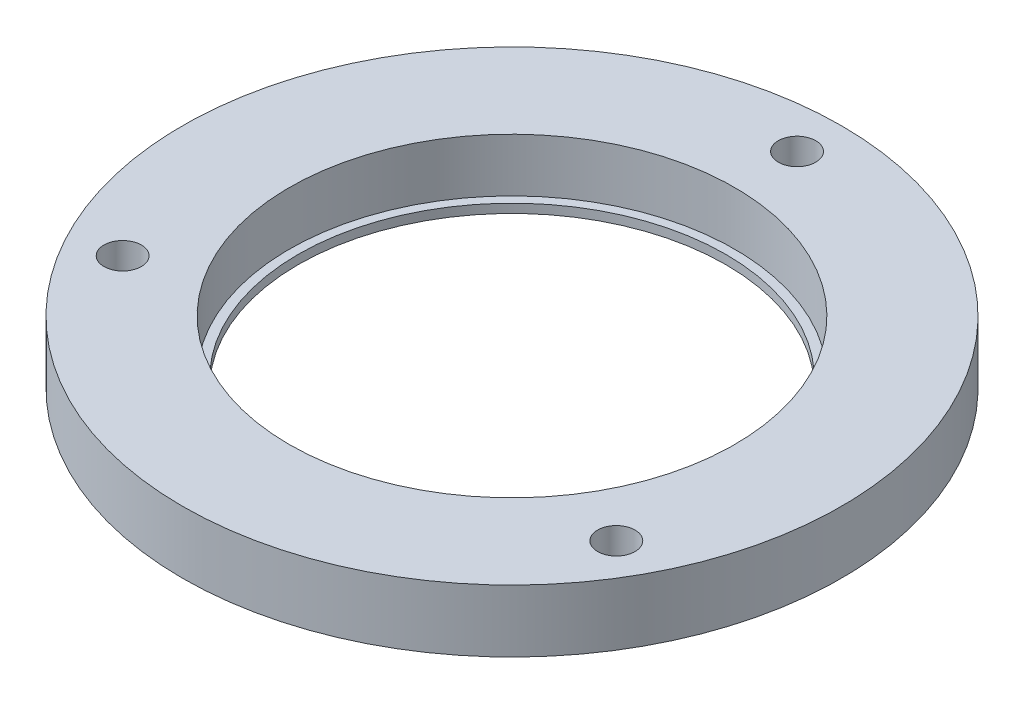
ISO-10303-21;
HEADER;
FILE_DESCRIPTION(('STEP AP214'),'2;1');
FILE_NAME('part.step','',(''),(''),'','','');
FILE_SCHEMA(('AUTOMOTIVE_DESIGN { 1 0 10303 214 1 1 1 1 }'));
ENDSEC;
DATA;
#1=APPLICATION_CONTEXT('core data for automotive mechanical design processes');
#2=APPLICATION_PROTOCOL_DEFINITION('international standard','automotive_design',2000,#1);
#3=PRODUCT_CONTEXT('',#1,'mechanical');
#4=PRODUCT('Part','Part','',(#3));
#5=PRODUCT_RELATED_PRODUCT_CATEGORY('part','',(#4));
#6=PRODUCT_DEFINITION_FORMATION('','',#4);
#7=PRODUCT_DEFINITION_CONTEXT('part definition',#1,'design');
#8=PRODUCT_DEFINITION('design','',#6,#7);
#9=PRODUCT_DEFINITION_SHAPE('','',#8);
#10=(LENGTH_UNIT() NAMED_UNIT(*) SI_UNIT(.MILLI.,.METRE.));
#11=(NAMED_UNIT(*) PLANE_ANGLE_UNIT() SI_UNIT($,.RADIAN.));
#12=(NAMED_UNIT(*) SI_UNIT($,.STERADIAN.) SOLID_ANGLE_UNIT());
#13=UNCERTAINTY_MEASURE_WITH_UNIT(LENGTH_MEASURE(1.E-05),#10,'distance_accuracy_value','');
#14=(GEOMETRIC_REPRESENTATION_CONTEXT(3) GLOBAL_UNCERTAINTY_ASSIGNED_CONTEXT((#13)) GLOBAL_UNIT_ASSIGNED_CONTEXT((#10,
#11,#12)) REPRESENTATION_CONTEXT('',''));
#15=CARTESIAN_POINT('',(0.,0.,0.));
#16=DIRECTION('',(0.,0.,1.));
#17=DIRECTION('',(1.,0.,0.));
#18=AXIS2_PLACEMENT_3D('',#15,#16,#17);
#19=CARTESIAN_POINT('',(0.,6.,0.));
#20=DIRECTION('',(0.,-1.,0.));
#21=DIRECTION('',(0.,0.,-1.));
#22=AXIS2_PLACEMENT_3D('',#19,#20,#21);
#23=CYLINDRICAL_SURFACE('',#22,37.);
#24=CARTESIAN_POINT('',(0.,6.,0.));
#25=DIRECTION('',(0.,1.,0.));
#26=DIRECTION('',(0.,0.,1.));
#27=AXIS2_PLACEMENT_3D('',#24,#25,#26);
#28=CIRCLE('',#27,37.);
#29=CARTESIAN_POINT('',(0.,6.,37.));
#30=VERTEX_POINT('',#29);
#31=EDGE_CURVE('E10',#30,#30,#28,.T.);
#32=ORIENTED_EDGE('',*,*,#31,.F.);
#33=EDGE_LOOP('',(#32));
#34=FACE_BOUND('',#33,.T.);
#35=CARTESIAN_POINT('',(0.,-1.,0.));
#36=DIRECTION('',(0.,1.,0.));
#37=DIRECTION('',(0.,0.,1.));
#38=AXIS2_PLACEMENT_3D('',#35,#36,#37);
#39=CIRCLE('',#38,37.);
#40=CARTESIAN_POINT('',(0.,-1.,37.));
#41=VERTEX_POINT('',#40);
#42=EDGE_CURVE('E60',#41,#41,#39,.T.);
#43=ORIENTED_EDGE('',*,*,#42,.T.);
#44=EDGE_LOOP('',(#43));
#45=FACE_BOUND('',#44,.T.);
#46=ADVANCED_FACE('F37',(#34,#45),#23,.T.);
#47=CARTESIAN_POINT('',(0.,6.,0.));
#48=DIRECTION('',(0.,1.,0.));
#49=DIRECTION('',(0.,0.,1.));
#50=AXIS2_PLACEMENT_3D('',#47,#48,#49);
#51=PLANE('',#50);
#52=CARTESIAN_POINT('',(0.,6.,0.));
#53=DIRECTION('',(0.,1.,0.));
#54=DIRECTION('',(0.,0.,1.));
#55=AXIS2_PLACEMENT_3D('',#52,#53,#54);
#56=CIRCLE('',#55,25.);
#57=CARTESIAN_POINT('',(0.,6.,25.));
#58=VERTEX_POINT('',#57);
#59=EDGE_CURVE('E57',#58,#58,#56,.T.);
#60=ORIENTED_EDGE('',*,*,#59,.F.);
#61=EDGE_LOOP('',(#60));
#62=FACE_BOUND('',#61,.T.);
#63=CARTESIAN_POINT('',(27.712812921102,6.,16.0000000000001));
#64=DIRECTION('',(0.,1.,0.));
#65=DIRECTION('',(-0.866025403784436,0.,-0.500000000000004));
#66=AXIS2_PLACEMENT_3D('',#63,#64,#65);
#67=CIRCLE('',#66,2.1);
#68=CARTESIAN_POINT('',(25.8941595731547,6.,14.9500000000001));
#69=VERTEX_POINT('',#68);
#70=EDGE_CURVE('E47',#69,#69,#67,.T.);
#71=ORIENTED_EDGE('',*,*,#70,.F.);
#72=EDGE_LOOP('',(#71));
#73=FACE_BOUND('',#72,.T.);
#74=CARTESIAN_POINT('',(-27.7128129211022,6.,15.9999999999997));
#75=DIRECTION('',(0.,1.,0.));
#76=DIRECTION('',(0.866025403784443,0.,-0.499999999999992));
#77=AXIS2_PLACEMENT_3D('',#74,#75,#76);
#78=CIRCLE('',#77,2.1);
#79=CARTESIAN_POINT('',(-25.8941595731549,6.,14.9499999999998));
#80=VERTEX_POINT('',#79);
#81=EDGE_CURVE('E51',#80,#80,#78,.T.);
#82=ORIENTED_EDGE('',*,*,#81,.F.);
#83=EDGE_LOOP('',(#82));
#84=FACE_BOUND('',#83,.T.);
#85=CARTESIAN_POINT('',(0.,6.,-32.));
#86=DIRECTION('',(0.,1.,0.));
#87=DIRECTION('',(0.,0.,1.));
#88=AXIS2_PLACEMENT_3D('',#85,#86,#87);
#89=CIRCLE('',#88,2.1);
#90=CARTESIAN_POINT('',(0.,6.,-29.9));
#91=VERTEX_POINT('',#90);
#92=EDGE_CURVE('E43',#91,#91,#89,.T.);
#93=ORIENTED_EDGE('',*,*,#92,.F.);
#94=EDGE_LOOP('',(#93));
#95=FACE_BOUND('',#94,.T.);
#96=ORIENTED_EDGE('',*,*,#31,.T.);
#97=EDGE_LOOP('',(#96));
#98=FACE_BOUND('',#97,.T.);
#99=ADVANCED_FACE('F87',(#62,#73,#84,#95,#98),#51,.T.);
#100=CARTESIAN_POINT('',(0.,0.,-32.));
#101=DIRECTION('',(0.,1.,0.));
#102=DIRECTION('',(0.,0.,1.));
#103=AXIS2_PLACEMENT_3D('',#100,#101,#102);
#104=CYLINDRICAL_SURFACE('',#103,2.1);
#105=ORIENTED_EDGE('',*,*,#92,.T.);
#106=EDGE_LOOP('',(#105));
#107=FACE_BOUND('',#106,.T.);
#108=CARTESIAN_POINT('',(0.,-1.,-32.));
#109=DIRECTION('',(0.,1.,0.));
#110=DIRECTION('',(0.,0.,1.));
#111=AXIS2_PLACEMENT_3D('',#108,#109,#110);
#112=CIRCLE('',#111,2.1);
#113=CARTESIAN_POINT('',(0.,-1.,-29.9));
#114=VERTEX_POINT('',#113);
#115=EDGE_CURVE('E77',#114,#114,#112,.T.);
#116=ORIENTED_EDGE('',*,*,#115,.F.);
#117=EDGE_LOOP('',(#116));
#118=FACE_BOUND('',#117,.T.);
#119=ADVANCED_FACE('F84',(#107,#118),#104,.F.);
#120=CARTESIAN_POINT('',(-27.7128129211022,0.,15.9999999999997));
#121=DIRECTION('',(0.,1.,0.));
#122=DIRECTION('',(0.,0.,1.));
#123=AXIS2_PLACEMENT_3D('',#120,#121,#122);
#124=CYLINDRICAL_SURFACE('',#123,2.1);
#125=ORIENTED_EDGE('',*,*,#81,.T.);
#126=EDGE_LOOP('',(#125));
#127=FACE_BOUND('',#126,.T.);
#128=CARTESIAN_POINT('',(-27.7128129211022,-1.,15.9999999999997));
#129=DIRECTION('',(0.,1.,0.));
#130=DIRECTION('',(0.,0.,1.));
#131=AXIS2_PLACEMENT_3D('',#128,#129,#130);
#132=CIRCLE('',#131,2.1);
#133=CARTESIAN_POINT('',(-27.7128129211022,-1.,18.0999999999997));
#134=VERTEX_POINT('',#133);
#135=EDGE_CURVE('E69',#134,#134,#132,.T.);
#136=ORIENTED_EDGE('',*,*,#135,.F.);
#137=EDGE_LOOP('',(#136));
#138=FACE_BOUND('',#137,.T.);
#139=ADVANCED_FACE('F86',(#127,#138),#124,.F.);
#140=CARTESIAN_POINT('',(27.712812921102,0.,16.0000000000001));
#141=DIRECTION('',(0.,1.,0.));
#142=DIRECTION('',(0.,0.,1.));
#143=AXIS2_PLACEMENT_3D('',#140,#141,#142);
#144=CYLINDRICAL_SURFACE('',#143,2.1);
#145=ORIENTED_EDGE('',*,*,#70,.T.);
#146=EDGE_LOOP('',(#145));
#147=FACE_BOUND('',#146,.T.);
#148=CARTESIAN_POINT('',(27.712812921102,-1.,16.0000000000001));
#149=DIRECTION('',(0.,1.,0.));
#150=DIRECTION('',(0.,0.,1.));
#151=AXIS2_PLACEMENT_3D('',#148,#149,#150);
#152=CIRCLE('',#151,2.1);
#153=CARTESIAN_POINT('',(27.712812921102,-1.,18.1000000000001));
#154=VERTEX_POINT('',#153);
#155=EDGE_CURVE('E74',#154,#154,#152,.T.);
#156=ORIENTED_EDGE('',*,*,#155,.F.);
#157=EDGE_LOOP('',(#156));
#158=FACE_BOUND('',#157,.T.);
#159=ADVANCED_FACE('F93',(#147,#158),#144,.F.);
#160=CARTESIAN_POINT('',(0.,0.,0.));
#161=DIRECTION('',(0.,1.,0.));
#162=DIRECTION('',(0.,0.,1.));
#163=AXIS2_PLACEMENT_3D('',#160,#161,#162);
#164=CYLINDRICAL_SURFACE('',#163,25.);
#165=CARTESIAN_POINT('',(0.,0.,0.));
#166=DIRECTION('',(0.,1.,0.));
#167=DIRECTION('',(0.,0.,1.));
#168=AXIS2_PLACEMENT_3D('',#165,#166,#167);
#169=CIRCLE('',#168,25.);
#170=CARTESIAN_POINT('',(0.,0.,25.));
#171=VERTEX_POINT('',#170);
#172=EDGE_CURVE('E55',#171,#171,#169,.T.);
#173=ORIENTED_EDGE('',*,*,#172,.F.);
#174=EDGE_LOOP('',(#173));
#175=FACE_BOUND('',#174,.T.);
#176=ORIENTED_EDGE('',*,*,#59,.T.);
#177=EDGE_LOOP('',(#176));
#178=FACE_BOUND('',#177,.T.);
#179=ADVANCED_FACE('F115',(#175,#178),#164,.F.);
#180=CARTESIAN_POINT('',(0.,0.,0.));
#181=DIRECTION('',(0.,1.,0.));
#182=DIRECTION('',(0.,0.,1.));
#183=AXIS2_PLACEMENT_3D('',#180,#181,#182);
#184=PLANE('',#183);
#185=CARTESIAN_POINT('',(0.,0.,0.));
#186=DIRECTION('',(0.,1.,0.));
#187=DIRECTION('',(0.,0.,1.));
#188=AXIS2_PLACEMENT_3D('',#185,#186,#187);
#189=CIRCLE('',#188,24.);
#190=CARTESIAN_POINT('',(0.,0.,24.));
#191=VERTEX_POINT('',#190);
#192=EDGE_CURVE('E66',#191,#191,#189,.T.);
#193=ORIENTED_EDGE('',*,*,#192,.F.);
#194=EDGE_LOOP('',(#193));
#195=FACE_BOUND('',#194,.T.);
#196=ORIENTED_EDGE('',*,*,#172,.T.);
#197=EDGE_LOOP('',(#196));
#198=FACE_BOUND('',#197,.T.);
#199=ADVANCED_FACE('F107',(#195,#198),#184,.T.);
#200=CARTESIAN_POINT('',(0.,-1.,0.));
#201=DIRECTION('',(0.,1.,0.));
#202=DIRECTION('',(0.,0.,1.));
#203=AXIS2_PLACEMENT_3D('',#200,#201,#202);
#204=PLANE('',#203);
#205=ORIENTED_EDGE('',*,*,#115,.T.);
#206=EDGE_LOOP('',(#205));
#207=FACE_BOUND('',#206,.T.);
#208=ORIENTED_EDGE('',*,*,#155,.T.);
#209=EDGE_LOOP('',(#208));
#210=FACE_BOUND('',#209,.T.);
#211=ORIENTED_EDGE('',*,*,#135,.T.);
#212=EDGE_LOOP('',(#211));
#213=FACE_BOUND('',#212,.T.);
#214=CARTESIAN_POINT('',(0.,-1.,0.));
#215=DIRECTION('',(0.,1.,0.));
#216=DIRECTION('',(0.,0.,1.));
#217=AXIS2_PLACEMENT_3D('',#214,#215,#216);
#218=CIRCLE('',#217,24.);
#219=CARTESIAN_POINT('',(0.,-1.,24.));
#220=VERTEX_POINT('',#219);
#221=EDGE_CURVE('E65',#220,#220,#218,.T.);
#222=ORIENTED_EDGE('',*,*,#221,.T.);
#223=EDGE_LOOP('',(#222));
#224=FACE_BOUND('',#223,.T.);
#225=ORIENTED_EDGE('',*,*,#42,.F.);
#226=EDGE_LOOP('',(#225));
#227=FACE_BOUND('',#226,.T.);
#228=ADVANCED_FACE('F81',(#207,#210,#213,#224,#227),#204,.F.);
#229=CARTESIAN_POINT('',(0.,-1.,0.));
#230=DIRECTION('',(0.,1.,0.));
#231=DIRECTION('',(0.,0.,1.));
#232=AXIS2_PLACEMENT_3D('',#229,#230,#231);
#233=CYLINDRICAL_SURFACE('',#232,24.);
#234=ORIENTED_EDGE('',*,*,#221,.F.);
#235=EDGE_LOOP('',(#234));
#236=FACE_BOUND('',#235,.T.);
#237=ORIENTED_EDGE('',*,*,#192,.T.);
#238=EDGE_LOOP('',(#237));
#239=FACE_BOUND('',#238,.T.);
#240=ADVANCED_FACE('F106',(#236,#239),#233,.F.);
#241=CLOSED_SHELL('',(#46,#99,#119,#139,#159,#179,#199,#228,#240));
#242=MANIFOLD_SOLID_BREP('B2',#241);
#243=ADVANCED_BREP_SHAPE_REPRESENTATION('',(#18,#242),#14);
#244=SHAPE_DEFINITION_REPRESENTATION(#9,#243);
ENDSEC;
END-ISO-10303-21;
